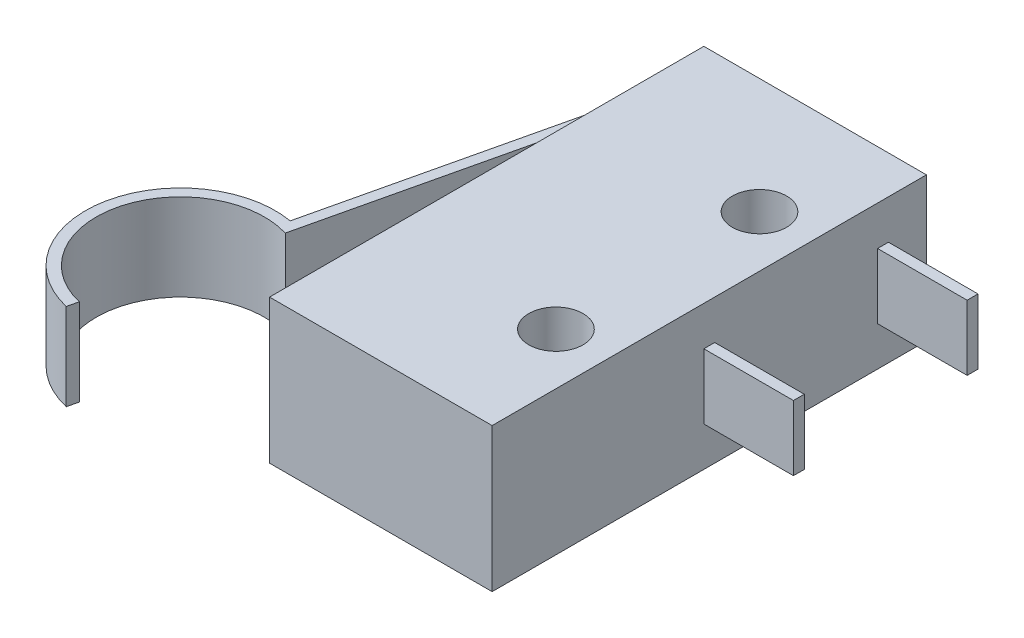
ISO-10303-21;
HEADER;
FILE_DESCRIPTION(('STEP AP214'),'2;1');
FILE_NAME('part.step','',(''),(''),'','','');
FILE_SCHEMA(('AUTOMOTIVE_DESIGN { 1 0 10303 214 1 1 1 1 }'));
ENDSEC;
DATA;
#1=APPLICATION_CONTEXT('core data for automotive mechanical design processes');
#2=APPLICATION_PROTOCOL_DEFINITION('international standard','automotive_design',2000,#1);
#3=PRODUCT_CONTEXT('',#1,'mechanical');
#4=PRODUCT('Part','Part','',(#3));
#5=PRODUCT_RELATED_PRODUCT_CATEGORY('part','',(#4));
#6=PRODUCT_DEFINITION_FORMATION('','',#4);
#7=PRODUCT_DEFINITION_CONTEXT('part definition',#1,'design');
#8=PRODUCT_DEFINITION('design','',#6,#7);
#9=PRODUCT_DEFINITION_SHAPE('','',#8);
#10=(LENGTH_UNIT() NAMED_UNIT(*) SI_UNIT(.MILLI.,.METRE.));
#11=(NAMED_UNIT(*) PLANE_ANGLE_UNIT() SI_UNIT($,.RADIAN.));
#12=(NAMED_UNIT(*) SI_UNIT($,.STERADIAN.) SOLID_ANGLE_UNIT());
#13=UNCERTAINTY_MEASURE_WITH_UNIT(LENGTH_MEASURE(1.E-05),#10,'distance_accuracy_value','');
#14=(GEOMETRIC_REPRESENTATION_CONTEXT(3) GLOBAL_UNCERTAINTY_ASSIGNED_CONTEXT((#13)) GLOBAL_UNIT_ASSIGNED_CONTEXT((#10,
#11,#12)) REPRESENTATION_CONTEXT('',''));
#15=CARTESIAN_POINT('',(0.,0.,0.));
#16=DIRECTION('',(0.,0.,1.));
#17=DIRECTION('',(1.,0.,0.));
#18=AXIS2_PLACEMENT_3D('',#15,#16,#17);
#19=CARTESIAN_POINT('',(0.,3.3655,-10.16));
#20=DIRECTION('',(0.,0.,1.));
#21=DIRECTION('',(1.,0.,0.));
#22=AXIS2_PLACEMENT_3D('',#19,#20,#21);
#23=PLANE('',#22);
#24=DIRECTION('',(-1.,0.,0.));
#25=VECTOR('',#24,1.);
#26=CARTESIAN_POINT('',(0.,-3.3655,-10.16));
#27=LINE('',#26,#25);
#28=CARTESIAN_POINT('',(5.207,-3.3655,-10.16));
#29=VERTEX_POINT('',#28);
#30=CARTESIAN_POINT('',(-5.207,-3.3655,-10.16));
#31=VERTEX_POINT('',#30);
#32=EDGE_CURVE('E397',#29,#31,#27,.T.);
#33=ORIENTED_EDGE('',*,*,#32,.T.);
#34=DIRECTION('',(0.,-1.,0.));
#35=VECTOR('',#34,1.);
#36=CARTESIAN_POINT('',(-5.207,3.3655,-10.16));
#37=LINE('',#36,#35);
#38=CARTESIAN_POINT('',(-5.207,3.3655,-10.16));
#39=VERTEX_POINT('',#38);
#40=EDGE_CURVE('E11',#39,#31,#37,.T.);
#41=ORIENTED_EDGE('',*,*,#40,.F.);
#42=DIRECTION('',(-1.,0.,0.));
#43=VECTOR('',#42,1.);
#44=CARTESIAN_POINT('',(0.,3.3655,-10.16));
#45=LINE('',#44,#43);
#46=CARTESIAN_POINT('',(5.207,3.3655,-10.16));
#47=VERTEX_POINT('',#46);
#48=EDGE_CURVE('E374',#47,#39,#45,.T.);
#49=ORIENTED_EDGE('',*,*,#48,.F.);
#50=DIRECTION('',(0.,-1.,0.));
#51=VECTOR('',#50,1.);
#52=CARTESIAN_POINT('',(5.207,3.3655,-10.16));
#53=LINE('',#52,#51);
#54=EDGE_CURVE('E389',#47,#29,#53,.T.);
#55=ORIENTED_EDGE('',*,*,#54,.T.);
#56=EDGE_LOOP('',(#33,#41,#49,#55));
#57=FACE_BOUND('',#56,.T.);
#58=ADVANCED_FACE('F45',(#57),#23,.F.);
#59=CARTESIAN_POINT('',(-5.207,3.3655,0.));
#60=DIRECTION('',(1.,0.,0.));
#61=DIRECTION('',(0.,0.,-1.));
#62=AXIS2_PLACEMENT_3D('',#59,#60,#61);
#63=PLANE('',#62);
#64=DIRECTION('',(0.,-1.,0.));
#65=VECTOR('',#64,1.);
#66=CARTESIAN_POINT('',(-5.207,2.032,-7.493));
#67=LINE('',#66,#65);
#68=CARTESIAN_POINT('',(-5.207,2.032,-7.493));
#69=VERTEX_POINT('',#68);
#70=CARTESIAN_POINT('',(-5.207,-2.032,-7.493));
#71=VERTEX_POINT('',#70);
#72=EDGE_CURVE('E66',#69,#71,#67,.T.);
#73=ORIENTED_EDGE('',*,*,#72,.F.);
#74=DIRECTION('',(0.,0.,1.));
#75=VECTOR('',#74,1.);
#76=CARTESIAN_POINT('',(-5.207,2.032,0.));
#77=LINE('',#76,#75);
#78=CARTESIAN_POINT('',(-5.207,2.032,-6.985));
#79=VERTEX_POINT('',#78);
#80=EDGE_CURVE('E61',#69,#79,#77,.T.);
#81=ORIENTED_EDGE('',*,*,#80,.T.);
#82=DIRECTION('',(0.,-1.,0.));
#83=VECTOR('',#82,1.);
#84=CARTESIAN_POINT('',(-5.207,2.032,-6.985));
#85=LINE('',#84,#83);
#86=CARTESIAN_POINT('',(-5.207,-2.032,-6.985));
#87=VERTEX_POINT('',#86);
#88=EDGE_CURVE('E270',#79,#87,#85,.T.);
#89=ORIENTED_EDGE('',*,*,#88,.T.);
#90=DIRECTION('',(0.,0.,1.));
#91=VECTOR('',#90,1.);
#92=CARTESIAN_POINT('',(-5.207,-2.032,0.));
#93=LINE('',#92,#91);
#94=EDGE_CURVE('E238',#71,#87,#93,.T.);
#95=ORIENTED_EDGE('',*,*,#94,.F.);
#96=EDGE_LOOP('',(#73,#81,#89,#95));
#97=FACE_BOUND('',#96,.T.);
#98=DIRECTION('',(0.,0.,1.));
#99=VECTOR('',#98,1.);
#100=CARTESIAN_POINT('',(-5.207,-3.3655,0.));
#101=LINE('',#100,#99);
#102=CARTESIAN_POINT('',(-5.207,-3.3655,10.16));
#103=VERTEX_POINT('',#102);
#104=EDGE_CURVE('E401',#31,#103,#101,.T.);
#105=ORIENTED_EDGE('',*,*,#104,.T.);
#106=DIRECTION('',(0.,-1.,0.));
#107=VECTOR('',#106,1.);
#108=CARTESIAN_POINT('',(-5.207,3.3655,10.16));
#109=LINE('',#108,#107);
#110=CARTESIAN_POINT('',(-5.207,3.3655,10.16));
#111=VERTEX_POINT('',#110);
#112=EDGE_CURVE('E54',#111,#103,#109,.T.);
#113=ORIENTED_EDGE('',*,*,#112,.F.);
#114=DIRECTION('',(0.,0.,1.));
#115=VECTOR('',#114,1.);
#116=CARTESIAN_POINT('',(-5.207,3.3655,0.));
#117=LINE('',#116,#115);
#118=EDGE_CURVE('E378',#39,#111,#117,.T.);
#119=ORIENTED_EDGE('',*,*,#118,.F.);
#120=ORIENTED_EDGE('',*,*,#40,.T.);
#121=EDGE_LOOP('',(#105,#113,#119,#120));
#122=FACE_BOUND('',#121,.T.);
#123=ADVANCED_FACE('F423',(#97,#122),#63,.F.);
#124=CARTESIAN_POINT('',(0.,3.3655,10.16));
#125=DIRECTION('',(0.,0.,1.));
#126=DIRECTION('',(1.,0.,0.));
#127=AXIS2_PLACEMENT_3D('',#124,#125,#126);
#128=PLANE('',#127);
#129=DIRECTION('',(-1.,0.,0.));
#130=VECTOR('',#129,1.);
#131=CARTESIAN_POINT('',(0.,-3.3655,10.16));
#132=LINE('',#131,#130);
#133=CARTESIAN_POINT('',(5.207,-3.3655,10.16));
#134=VERTEX_POINT('',#133);
#135=EDGE_CURVE('E405',#134,#103,#132,.T.);
#136=ORIENTED_EDGE('',*,*,#135,.F.);
#137=DIRECTION('',(0.,-1.,0.));
#138=VECTOR('',#137,1.);
#139=CARTESIAN_POINT('',(5.207,3.3655,10.16));
#140=LINE('',#139,#138);
#141=CARTESIAN_POINT('',(5.207,3.3655,10.16));
#142=VERTEX_POINT('',#141);
#143=EDGE_CURVE('E414',#142,#134,#140,.T.);
#144=ORIENTED_EDGE('',*,*,#143,.F.);
#145=DIRECTION('',(-1.,0.,0.));
#146=VECTOR('',#145,1.);
#147=CARTESIAN_POINT('',(0.,3.3655,10.16));
#148=LINE('',#147,#146);
#149=EDGE_CURVE('E381',#142,#111,#148,.T.);
#150=ORIENTED_EDGE('',*,*,#149,.T.);
#151=ORIENTED_EDGE('',*,*,#112,.T.);
#152=EDGE_LOOP('',(#136,#144,#150,#151));
#153=FACE_BOUND('',#152,.T.);
#154=ADVANCED_FACE('F420',(#153),#128,.T.);
#155=CARTESIAN_POINT('',(2.794,3.3655,-4.7625));
#156=DIRECTION('',(0.,-1.,0.));
#157=DIRECTION('',(0.,0.,-1.));
#158=AXIS2_PLACEMENT_3D('',#155,#156,#157);
#159=CYLINDRICAL_SURFACE('',#158,1.27);
#160=CARTESIAN_POINT('',(2.794,3.3655,-4.7625));
#161=DIRECTION('',(0.,1.,0.));
#162=DIRECTION('',(0.,0.,1.));
#163=AXIS2_PLACEMENT_3D('',#160,#161,#162);
#164=CIRCLE('',#163,1.27);
#165=CARTESIAN_POINT('',(2.794,3.3655,-3.4925));
#166=VERTEX_POINT('',#165);
#167=EDGE_CURVE('E369',#166,#166,#164,.T.);
#168=ORIENTED_EDGE('',*,*,#167,.T.);
#169=EDGE_LOOP('',(#168));
#170=FACE_BOUND('',#169,.T.);
#171=CARTESIAN_POINT('',(2.794,-3.3655,-4.7625));
#172=DIRECTION('',(0.,1.,0.));
#173=DIRECTION('',(0.,0.,1.));
#174=AXIS2_PLACEMENT_3D('',#171,#172,#173);
#175=CIRCLE('',#174,1.27);
#176=CARTESIAN_POINT('',(2.794,-3.3655,-3.4925));
#177=VERTEX_POINT('',#176);
#178=EDGE_CURVE('E393',#177,#177,#175,.T.);
#179=ORIENTED_EDGE('',*,*,#178,.F.);
#180=EDGE_LOOP('',(#179));
#181=FACE_BOUND('',#180,.T.);
#182=ADVANCED_FACE('F443',(#170,#181),#159,.F.);
#183=CARTESIAN_POINT('',(2.794,3.3655,4.7625));
#184=DIRECTION('',(0.,-1.,0.));
#185=DIRECTION('',(0.,0.,-1.));
#186=AXIS2_PLACEMENT_3D('',#183,#184,#185);
#187=CYLINDRICAL_SURFACE('',#186,1.27);
#188=CARTESIAN_POINT('',(2.794,3.3655,4.7625));
#189=DIRECTION('',(0.,1.,0.));
#190=DIRECTION('',(0.,0.,1.));
#191=AXIS2_PLACEMENT_3D('',#188,#189,#190);
#192=CIRCLE('',#191,1.27);
#193=CARTESIAN_POINT('',(2.794,3.3655,6.0325));
#194=VERTEX_POINT('',#193);
#195=EDGE_CURVE('E365',#194,#194,#192,.T.);
#196=ORIENTED_EDGE('',*,*,#195,.T.);
#197=EDGE_LOOP('',(#196));
#198=FACE_BOUND('',#197,.T.);
#199=CARTESIAN_POINT('',(2.794,-3.3655,4.7625));
#200=DIRECTION('',(0.,1.,0.));
#201=DIRECTION('',(0.,0.,1.));
#202=AXIS2_PLACEMENT_3D('',#199,#200,#201);
#203=CIRCLE('',#202,1.27);
#204=CARTESIAN_POINT('',(2.794,-3.3655,6.0325));
#205=VERTEX_POINT('',#204);
#206=EDGE_CURVE('E364',#205,#205,#203,.T.);
#207=ORIENTED_EDGE('',*,*,#206,.F.);
#208=EDGE_LOOP('',(#207));
#209=FACE_BOUND('',#208,.T.);
#210=ADVANCED_FACE('F47',(#198,#209),#187,.F.);
#211=CARTESIAN_POINT('',(5.207,3.3655,0.));
#212=DIRECTION('',(1.,0.,0.));
#213=DIRECTION('',(0.,0.,-1.));
#214=AXIS2_PLACEMENT_3D('',#211,#212,#213);
#215=PLANE('',#214);
#216=DIRECTION('',(0.,0.,1.));
#217=VECTOR('',#216,1.);
#218=CARTESIAN_POINT('',(5.207,1.524,0.));
#219=LINE('',#218,#217);
#220=CARTESIAN_POINT('',(5.207,1.524,-8.382));
#221=VERTEX_POINT('',#220);
#222=CARTESIAN_POINT('',(5.207,1.524,-7.874));
#223=VERTEX_POINT('',#222);
#224=EDGE_CURVE('E287',#221,#223,#219,.T.);
#225=ORIENTED_EDGE('',*,*,#224,.F.);
#226=DIRECTION('',(0.,-1.,0.));
#227=VECTOR('',#226,1.);
#228=CARTESIAN_POINT('',(5.207,1.524,-8.382));
#229=LINE('',#228,#227);
#230=CARTESIAN_POINT('',(5.207,-1.524,-8.382));
#231=VERTEX_POINT('',#230);
#232=EDGE_CURVE('E308',#221,#231,#229,.T.);
#233=ORIENTED_EDGE('',*,*,#232,.T.);
#234=DIRECTION('',(0.,0.,1.));
#235=VECTOR('',#234,1.);
#236=CARTESIAN_POINT('',(5.207,-1.524,0.));
#237=LINE('',#236,#235);
#238=CARTESIAN_POINT('',(5.207,-1.524,-7.874));
#239=VERTEX_POINT('',#238);
#240=EDGE_CURVE('E280',#231,#239,#237,.T.);
#241=ORIENTED_EDGE('',*,*,#240,.T.);
#242=DIRECTION('',(0.,-1.,0.));
#243=VECTOR('',#242,1.);
#244=CARTESIAN_POINT('',(5.207,1.524,-7.874));
#245=LINE('',#244,#243);
#246=EDGE_CURVE('E290',#223,#239,#245,.T.);
#247=ORIENTED_EDGE('',*,*,#246,.F.);
#248=EDGE_LOOP('',(#225,#233,#241,#247));
#249=FACE_BOUND('',#248,.T.);
#250=DIRECTION('',(0.,0.,1.));
#251=VECTOR('',#250,1.);
#252=CARTESIAN_POINT('',(5.207,1.524,0.));
#253=LINE('',#252,#251);
#254=CARTESIAN_POINT('',(5.207,1.524,-0.253999999999999));
#255=VERTEX_POINT('',#254);
#256=CARTESIAN_POINT('',(5.207,1.524,0.254));
#257=VERTEX_POINT('',#256);
#258=EDGE_CURVE('E332',#255,#257,#253,.T.);
#259=ORIENTED_EDGE('',*,*,#258,.F.);
#260=DIRECTION('',(0.,-1.,0.));
#261=VECTOR('',#260,1.);
#262=CARTESIAN_POINT('',(5.207,1.524,-0.253999999999999));
#263=LINE('',#262,#261);
#264=CARTESIAN_POINT('',(5.207,-1.524,-0.253999999999999));
#265=VERTEX_POINT('',#264);
#266=EDGE_CURVE('E353',#255,#265,#263,.T.);
#267=ORIENTED_EDGE('',*,*,#266,.T.);
#268=DIRECTION('',(0.,0.,1.));
#269=VECTOR('',#268,1.);
#270=CARTESIAN_POINT('',(5.207,-1.524,0.));
#271=LINE('',#270,#269);
#272=CARTESIAN_POINT('',(5.207,-1.524,0.254));
#273=VERTEX_POINT('',#272);
#274=EDGE_CURVE('E325',#265,#273,#271,.T.);
#275=ORIENTED_EDGE('',*,*,#274,.T.);
#276=DIRECTION('',(0.,-1.,0.));
#277=VECTOR('',#276,1.);
#278=CARTESIAN_POINT('',(5.207,1.524,0.254));
#279=LINE('',#278,#277);
#280=EDGE_CURVE('E335',#257,#273,#279,.T.);
#281=ORIENTED_EDGE('',*,*,#280,.F.);
#282=EDGE_LOOP('',(#259,#267,#275,#281));
#283=FACE_BOUND('',#282,.T.);
#284=DIRECTION('',(0.,0.,1.));
#285=VECTOR('',#284,1.);
#286=CARTESIAN_POINT('',(5.207,-3.3655,0.));
#287=LINE('',#286,#285);
#288=EDGE_CURVE('E370',#29,#134,#287,.T.);
#289=ORIENTED_EDGE('',*,*,#288,.F.);
#290=ORIENTED_EDGE('',*,*,#54,.F.);
#291=DIRECTION('',(0.,0.,1.));
#292=VECTOR('',#291,1.);
#293=CARTESIAN_POINT('',(5.207,3.3655,0.));
#294=LINE('',#293,#292);
#295=EDGE_CURVE('E385',#47,#142,#294,.T.);
#296=ORIENTED_EDGE('',*,*,#295,.T.);
#297=ORIENTED_EDGE('',*,*,#143,.T.);
#298=EDGE_LOOP('',(#289,#290,#296,#297));
#299=FACE_BOUND('',#298,.T.);
#300=ADVANCED_FACE('F430',(#249,#283,#299),#215,.T.);
#301=CARTESIAN_POINT('',(0.,3.3655,0.));
#302=DIRECTION('',(0.,1.,0.));
#303=DIRECTION('',(0.,0.,1.));
#304=AXIS2_PLACEMENT_3D('',#301,#302,#303);
#305=PLANE('',#304);
#306=ORIENTED_EDGE('',*,*,#195,.F.);
#307=EDGE_LOOP('',(#306));
#308=FACE_BOUND('',#307,.T.);
#309=ORIENTED_EDGE('',*,*,#167,.F.);
#310=EDGE_LOOP('',(#309));
#311=FACE_BOUND('',#310,.T.);
#312=ORIENTED_EDGE('',*,*,#48,.T.);
#313=ORIENTED_EDGE('',*,*,#118,.T.);
#314=ORIENTED_EDGE('',*,*,#149,.F.);
#315=ORIENTED_EDGE('',*,*,#295,.F.);
#316=EDGE_LOOP('',(#312,#313,#314,#315));
#317=FACE_BOUND('',#316,.T.);
#318=ADVANCED_FACE('F434',(#308,#311,#317),#305,.T.);
#319=CARTESIAN_POINT('',(0.,-3.3655,0.));
#320=DIRECTION('',(0.,1.,0.));
#321=DIRECTION('',(0.,0.,1.));
#322=AXIS2_PLACEMENT_3D('',#319,#320,#321);
#323=PLANE('',#322);
#324=ORIENTED_EDGE('',*,*,#206,.T.);
#325=EDGE_LOOP('',(#324));
#326=FACE_BOUND('',#325,.T.);
#327=ORIENTED_EDGE('',*,*,#178,.T.);
#328=EDGE_LOOP('',(#327));
#329=FACE_BOUND('',#328,.T.);
#330=ORIENTED_EDGE('',*,*,#32,.F.);
#331=ORIENTED_EDGE('',*,*,#288,.T.);
#332=ORIENTED_EDGE('',*,*,#135,.T.);
#333=ORIENTED_EDGE('',*,*,#104,.F.);
#334=EDGE_LOOP('',(#330,#331,#332,#333));
#335=FACE_BOUND('',#334,.T.);
#336=ADVANCED_FACE('F427',(#326,#329,#335),#323,.F.);
#337=CARTESIAN_POINT('',(0.,1.524,0.254));
#338=DIRECTION('',(0.,0.,-1.));
#339=DIRECTION('',(-1.,0.,0.));
#340=AXIS2_PLACEMENT_3D('',#337,#338,#339);
#341=PLANE('',#340);
#342=DIRECTION('',(1.,0.,0.));
#343=VECTOR('',#342,1.);
#344=CARTESIAN_POINT('',(0.,-1.524,0.254));
#345=LINE('',#344,#343);
#346=CARTESIAN_POINT('',(9.398,-1.524,0.254));
#347=VERTEX_POINT('',#346);
#348=EDGE_CURVE('E319',#273,#347,#345,.T.);
#349=ORIENTED_EDGE('',*,*,#348,.T.);
#350=DIRECTION('',(0.,-1.,0.));
#351=VECTOR('',#350,1.);
#352=CARTESIAN_POINT('',(9.398,1.524,0.254));
#353=LINE('',#352,#351);
#354=CARTESIAN_POINT('',(9.398,1.524,0.254));
#355=VERTEX_POINT('',#354);
#356=EDGE_CURVE('E360',#355,#347,#353,.T.);
#357=ORIENTED_EDGE('',*,*,#356,.F.);
#358=DIRECTION('',(1.,0.,0.));
#359=VECTOR('',#358,1.);
#360=CARTESIAN_POINT('',(0.,1.524,0.254));
#361=LINE('',#360,#359);
#362=EDGE_CURVE('E320',#257,#355,#361,.T.);
#363=ORIENTED_EDGE('',*,*,#362,.F.);
#364=ORIENTED_EDGE('',*,*,#280,.T.);
#365=EDGE_LOOP('',(#349,#357,#363,#364));
#366=FACE_BOUND('',#365,.T.);
#367=ADVANCED_FACE('F456',(#366),#341,.F.);
#368=CARTESIAN_POINT('',(9.398,1.524,0.));
#369=DIRECTION('',(-1.,0.,0.));
#370=DIRECTION('',(0.,0.,1.));
#371=AXIS2_PLACEMENT_3D('',#368,#369,#370);
#372=PLANE('',#371);
#373=DIRECTION('',(0.,0.,-1.));
#374=VECTOR('',#373,1.);
#375=CARTESIAN_POINT('',(9.398,-1.524,0.));
#376=LINE('',#375,#374);
#377=CARTESIAN_POINT('',(9.398,-1.524,-0.254));
#378=VERTEX_POINT('',#377);
#379=EDGE_CURVE('E339',#347,#378,#376,.T.);
#380=ORIENTED_EDGE('',*,*,#379,.T.);
#381=DIRECTION('',(0.,-1.,0.));
#382=VECTOR('',#381,1.);
#383=CARTESIAN_POINT('',(9.398,1.524,-0.254));
#384=LINE('',#383,#382);
#385=CARTESIAN_POINT('',(9.398,1.524,-0.254));
#386=VERTEX_POINT('',#385);
#387=EDGE_CURVE('E357',#386,#378,#384,.T.);
#388=ORIENTED_EDGE('',*,*,#387,.F.);
#389=DIRECTION('',(0.,0.,-1.));
#390=VECTOR('',#389,1.);
#391=CARTESIAN_POINT('',(9.398,1.524,0.));
#392=LINE('',#391,#390);
#393=EDGE_CURVE('E324',#355,#386,#392,.T.);
#394=ORIENTED_EDGE('',*,*,#393,.F.);
#395=ORIENTED_EDGE('',*,*,#356,.T.);
#396=EDGE_LOOP('',(#380,#388,#394,#395));
#397=FACE_BOUND('',#396,.T.);
#398=ADVANCED_FACE('F463',(#397),#372,.F.);
#399=CARTESIAN_POINT('',(0.,1.524,-0.253999999999997));
#400=DIRECTION('',(0.,0.,-1.));
#401=DIRECTION('',(-1.,0.,0.));
#402=AXIS2_PLACEMENT_3D('',#399,#400,#401);
#403=PLANE('',#402);
#404=DIRECTION('',(1.,0.,0.));
#405=VECTOR('',#404,1.);
#406=CARTESIAN_POINT('',(0.,-1.524,-0.253999999999997));
#407=LINE('',#406,#405);
#408=EDGE_CURVE('E343',#265,#378,#407,.T.);
#409=ORIENTED_EDGE('',*,*,#408,.F.);
#410=ORIENTED_EDGE('',*,*,#266,.F.);
#411=DIRECTION('',(1.,0.,0.));
#412=VECTOR('',#411,1.);
#413=CARTESIAN_POINT('',(0.,1.524,-0.253999999999997));
#414=LINE('',#413,#412);
#415=EDGE_CURVE('E328',#255,#386,#414,.T.);
#416=ORIENTED_EDGE('',*,*,#415,.T.);
#417=ORIENTED_EDGE('',*,*,#387,.T.);
#418=EDGE_LOOP('',(#409,#410,#416,#417));
#419=FACE_BOUND('',#418,.T.);
#420=ADVANCED_FACE('F487',(#419),#403,.T.);
#421=CARTESIAN_POINT('',(0.,1.524,0.));
#422=DIRECTION('',(0.,1.,0.));
#423=DIRECTION('',(0.,0.,1.));
#424=AXIS2_PLACEMENT_3D('',#421,#422,#423);
#425=PLANE('',#424);
#426=ORIENTED_EDGE('',*,*,#362,.T.);
#427=ORIENTED_EDGE('',*,*,#393,.T.);
#428=ORIENTED_EDGE('',*,*,#415,.F.);
#429=ORIENTED_EDGE('',*,*,#258,.T.);
#430=EDGE_LOOP('',(#426,#427,#428,#429));
#431=FACE_BOUND('',#430,.T.);
#432=ADVANCED_FACE('F481',(#431),#425,.T.);
#433=CARTESIAN_POINT('',(0.,-1.524,0.));
#434=DIRECTION('',(0.,1.,0.));
#435=DIRECTION('',(0.,0.,1.));
#436=AXIS2_PLACEMENT_3D('',#433,#434,#435);
#437=PLANE('',#436);
#438=ORIENTED_EDGE('',*,*,#348,.F.);
#439=ORIENTED_EDGE('',*,*,#274,.F.);
#440=ORIENTED_EDGE('',*,*,#408,.T.);
#441=ORIENTED_EDGE('',*,*,#379,.F.);
#442=EDGE_LOOP('',(#438,#439,#440,#441));
#443=FACE_BOUND('',#442,.T.);
#444=ADVANCED_FACE('F489',(#443),#437,.F.);
#445=CARTESIAN_POINT('',(0.,1.524,-7.874));
#446=DIRECTION('',(0.,0.,-1.));
#447=DIRECTION('',(-1.,0.,0.));
#448=AXIS2_PLACEMENT_3D('',#445,#446,#447);
#449=PLANE('',#448);
#450=DIRECTION('',(1.,0.,0.));
#451=VECTOR('',#450,1.);
#452=CARTESIAN_POINT('',(0.,-1.524,-7.874));
#453=LINE('',#452,#451);
#454=CARTESIAN_POINT('',(9.398,-1.524,-7.874));
#455=VERTEX_POINT('',#454);
#456=EDGE_CURVE('E194',#239,#455,#453,.T.);
#457=ORIENTED_EDGE('',*,*,#456,.T.);
#458=DIRECTION('',(0.,-1.,0.));
#459=VECTOR('',#458,1.);
#460=CARTESIAN_POINT('',(9.398,1.524,-7.874));
#461=LINE('',#460,#459);
#462=CARTESIAN_POINT('',(9.398,1.524,-7.874));
#463=VERTEX_POINT('',#462);
#464=EDGE_CURVE('E315',#463,#455,#461,.T.);
#465=ORIENTED_EDGE('',*,*,#464,.F.);
#466=DIRECTION('',(1.,0.,0.));
#467=VECTOR('',#466,1.);
#468=CARTESIAN_POINT('',(0.,1.524,-7.874));
#469=LINE('',#468,#467);
#470=EDGE_CURVE('E275',#223,#463,#469,.T.);
#471=ORIENTED_EDGE('',*,*,#470,.F.);
#472=ORIENTED_EDGE('',*,*,#246,.T.);
#473=EDGE_LOOP('',(#457,#465,#471,#472));
#474=FACE_BOUND('',#473,.T.);
#475=ADVANCED_FACE('F491',(#474),#449,.F.);
#476=CARTESIAN_POINT('',(9.398,1.524,0.));
#477=DIRECTION('',(-1.,0.,0.));
#478=DIRECTION('',(0.,0.,1.));
#479=AXIS2_PLACEMENT_3D('',#476,#477,#478);
#480=PLANE('',#479);
#481=DIRECTION('',(0.,0.,-1.));
#482=VECTOR('',#481,1.);
#483=CARTESIAN_POINT('',(9.398,-1.524,0.));
#484=LINE('',#483,#482);
#485=CARTESIAN_POINT('',(9.398,-1.524,-8.382));
#486=VERTEX_POINT('',#485);
#487=EDGE_CURVE('E294',#455,#486,#484,.T.);
#488=ORIENTED_EDGE('',*,*,#487,.T.);
#489=DIRECTION('',(0.,-1.,0.));
#490=VECTOR('',#489,1.);
#491=CARTESIAN_POINT('',(9.398,1.524,-8.382));
#492=LINE('',#491,#490);
#493=CARTESIAN_POINT('',(9.398,1.524,-8.382));
#494=VERTEX_POINT('',#493);
#495=EDGE_CURVE('E312',#494,#486,#492,.T.);
#496=ORIENTED_EDGE('',*,*,#495,.F.);
#497=DIRECTION('',(0.,0.,-1.));
#498=VECTOR('',#497,1.);
#499=CARTESIAN_POINT('',(9.398,1.524,0.));
#500=LINE('',#499,#498);
#501=EDGE_CURVE('E279',#463,#494,#500,.T.);
#502=ORIENTED_EDGE('',*,*,#501,.F.);
#503=ORIENTED_EDGE('',*,*,#464,.T.);
#504=EDGE_LOOP('',(#488,#496,#502,#503));
#505=FACE_BOUND('',#504,.T.);
#506=ADVANCED_FACE('F497',(#505),#480,.F.);
#507=CARTESIAN_POINT('',(0.,1.524,-8.382));
#508=DIRECTION('',(0.,0.,-1.));
#509=DIRECTION('',(-1.,0.,0.));
#510=AXIS2_PLACEMENT_3D('',#507,#508,#509);
#511=PLANE('',#510);
#512=DIRECTION('',(1.,0.,0.));
#513=VECTOR('',#512,1.);
#514=CARTESIAN_POINT('',(0.,-1.524,-8.382));
#515=LINE('',#514,#513);
#516=EDGE_CURVE('E298',#231,#486,#515,.T.);
#517=ORIENTED_EDGE('',*,*,#516,.F.);
#518=ORIENTED_EDGE('',*,*,#232,.F.);
#519=DIRECTION('',(1.,0.,0.));
#520=VECTOR('',#519,1.);
#521=CARTESIAN_POINT('',(0.,1.524,-8.382));
#522=LINE('',#521,#520);
#523=EDGE_CURVE('E283',#221,#494,#522,.T.);
#524=ORIENTED_EDGE('',*,*,#523,.T.);
#525=ORIENTED_EDGE('',*,*,#495,.T.);
#526=EDGE_LOOP('',(#517,#518,#524,#525));
#527=FACE_BOUND('',#526,.T.);
#528=ADVANCED_FACE('F539',(#527),#511,.T.);
#529=CARTESIAN_POINT('',(0.,1.524,0.));
#530=DIRECTION('',(0.,1.,0.));
#531=DIRECTION('',(0.,0.,1.));
#532=AXIS2_PLACEMENT_3D('',#529,#530,#531);
#533=PLANE('',#532);
#534=ORIENTED_EDGE('',*,*,#470,.T.);
#535=ORIENTED_EDGE('',*,*,#501,.T.);
#536=ORIENTED_EDGE('',*,*,#523,.F.);
#537=ORIENTED_EDGE('',*,*,#224,.T.);
#538=EDGE_LOOP('',(#534,#535,#536,#537));
#539=FACE_BOUND('',#538,.T.);
#540=ADVANCED_FACE('F550',(#539),#533,.T.);
#541=CARTESIAN_POINT('',(0.,-1.524,0.));
#542=DIRECTION('',(0.,1.,0.));
#543=DIRECTION('',(0.,0.,1.));
#544=AXIS2_PLACEMENT_3D('',#541,#542,#543);
#545=PLANE('',#544);
#546=ORIENTED_EDGE('',*,*,#456,.F.);
#547=ORIENTED_EDGE('',*,*,#240,.F.);
#548=ORIENTED_EDGE('',*,*,#516,.T.);
#549=ORIENTED_EDGE('',*,*,#487,.F.);
#550=EDGE_LOOP('',(#546,#547,#548,#549));
#551=FACE_BOUND('',#550,.T.);
#552=ADVANCED_FACE('F561',(#551),#545,.F.);
#553=CARTESIAN_POINT('',(-9.906,2.032,9.63462193862737));
#554=DIRECTION('',(0.,-1.,0.));
#555=DIRECTION('',(0.,0.,-1.));
#556=AXIS2_PLACEMENT_3D('',#553,#554,#555);
#557=CYLINDRICAL_SURFACE('',#556,3.937);
#558=CARTESIAN_POINT('',(-9.906,-2.032,9.63462193862737));
#559=DIRECTION('',(0.,1.,0.));
#560=DIRECTION('',(0.,0.,1.));
#561=AXIS2_PLACEMENT_3D('',#558,#559,#560);
#562=CIRCLE('',#561,3.937);
#563=CARTESIAN_POINT('',(-8.76594288970532,-2.032,5.86630151896205));
#564=VERTEX_POINT('',#563);
#565=CARTESIAN_POINT('',(-10.800564542305,-2.032,13.4686437538562));
#566=VERTEX_POINT('',#565);
#567=EDGE_CURVE('E188',#564,#566,#562,.T.);
#568=ORIENTED_EDGE('',*,*,#567,.F.);
#569=DIRECTION('',(0.,-1.,0.));
#570=VECTOR('',#569,1.);
#571=CARTESIAN_POINT('',(-8.76594288970532,2.032,5.86630151896205));
#572=LINE('',#571,#570);
#573=CARTESIAN_POINT('',(-8.76594288970532,2.032,5.86630151896205));
#574=VERTEX_POINT('',#573);
#575=EDGE_CURVE('E182',#574,#564,#572,.T.);
#576=ORIENTED_EDGE('',*,*,#575,.F.);
#577=CARTESIAN_POINT('',(-9.906,2.032,9.63462193862737));
#578=DIRECTION('',(0.,1.,0.));
#579=DIRECTION('',(0.,0.,1.));
#580=AXIS2_PLACEMENT_3D('',#577,#578,#579);
#581=CIRCLE('',#580,3.937);
#582=CARTESIAN_POINT('',(-10.800564542305,2.032,13.4686437538562));
#583=VERTEX_POINT('',#582);
#584=EDGE_CURVE('E185',#574,#583,#581,.T.);
#585=ORIENTED_EDGE('',*,*,#584,.T.);
#586=DIRECTION('',(0.,-1.,0.));
#587=VECTOR('',#586,1.);
#588=CARTESIAN_POINT('',(-10.800564542305,2.032,13.4686437538562));
#589=LINE('',#588,#587);
#590=EDGE_CURVE('E228',#583,#566,#589,.T.);
#591=ORIENTED_EDGE('',*,*,#590,.T.);
#592=EDGE_LOOP('',(#568,#576,#585,#591));
#593=FACE_BOUND('',#592,.T.);
#594=ADVANCED_FACE('F184',(#593),#557,.F.);
#595=CARTESIAN_POINT('',(-7.01529217989087,2.032,-1.63682731619131));
#596=DIRECTION('',(0.973843488755102,0.,0.227219848185168));
#597=DIRECTION('',(0.227219848185168,0.,-0.973843488755102));
#598=AXIS2_PLACEMENT_3D('',#595,#596,#597);
#599=PLANE('',#598);
#600=DIRECTION('',(-0.227219848185168,0.,0.973843488755102));
#601=VECTOR('',#600,1.);
#602=CARTESIAN_POINT('',(-7.01529217989087,-2.032,-1.63682731619131));
#603=LINE('',#602,#601);
#604=CARTESIAN_POINT('',(-5.76744178163384,-2.032,-6.985));
#605=VERTEX_POINT('',#604);
#606=EDGE_CURVE('E231',#605,#564,#603,.T.);
#607=ORIENTED_EDGE('',*,*,#606,.F.);
#608=DIRECTION('',(0.,-1.,0.));
#609=VECTOR('',#608,1.);
#610=CARTESIAN_POINT('',(-5.76744178163384,2.032,-6.985));
#611=LINE('',#610,#609);
#612=CARTESIAN_POINT('',(-5.76744178163384,2.032,-6.985));
#613=VERTEX_POINT('',#612);
#614=EDGE_CURVE('E195',#613,#605,#611,.T.);
#615=ORIENTED_EDGE('',*,*,#614,.F.);
#616=DIRECTION('',(-0.227219848185168,0.,0.973843488755102));
#617=VECTOR('',#616,1.);
#618=CARTESIAN_POINT('',(-7.01529217989087,2.032,-1.63682731619131));
#619=LINE('',#618,#617);
#620=EDGE_CURVE('E201',#613,#574,#619,.T.);
#621=ORIENTED_EDGE('',*,*,#620,.T.);
#622=ORIENTED_EDGE('',*,*,#575,.T.);
#623=EDGE_LOOP('',(#607,#615,#621,#622));
#624=FACE_BOUND('',#623,.T.);
#625=ADVANCED_FACE('F208',(#624),#599,.T.);
#626=CARTESIAN_POINT('',(0.,2.032,-6.985));
#627=DIRECTION('',(0.,0.,1.));
#628=DIRECTION('',(1.,0.,0.));
#629=AXIS2_PLACEMENT_3D('',#626,#627,#628);
#630=PLANE('',#629);
#631=DIRECTION('',(-1.,0.,0.));
#632=VECTOR('',#631,1.);
#633=CARTESIAN_POINT('',(0.,-2.032,-6.985));
#634=LINE('',#633,#632);
#635=EDGE_CURVE('E234',#87,#605,#634,.T.);
#636=ORIENTED_EDGE('',*,*,#635,.F.);
#637=ORIENTED_EDGE('',*,*,#88,.F.);
#638=DIRECTION('',(-1.,0.,0.));
#639=VECTOR('',#638,1.);
#640=CARTESIAN_POINT('',(0.,2.032,-6.985));
#641=LINE('',#640,#639);
#642=EDGE_CURVE('E210',#79,#613,#641,.T.);
#643=ORIENTED_EDGE('',*,*,#642,.T.);
#644=ORIENTED_EDGE('',*,*,#614,.T.);
#645=EDGE_LOOP('',(#636,#637,#643,#644));
#646=FACE_BOUND('',#645,.T.);
#647=ADVANCED_FACE('F600',(#646),#630,.T.);
#648=CARTESIAN_POINT('',(0.,2.032,-7.493));
#649=DIRECTION('',(0.,0.,1.));
#650=DIRECTION('',(1.,0.,0.));
#651=AXIS2_PLACEMENT_3D('',#648,#649,#650);
#652=PLANE('',#651);
#653=DIRECTION('',(-1.,0.,0.));
#654=VECTOR('',#653,1.);
#655=CARTESIAN_POINT('',(0.,-2.032,-7.493));
#656=LINE('',#655,#654);
#657=CARTESIAN_POINT('',(-6.17055821836616,-2.032,-7.493));
#658=VERTEX_POINT('',#657);
#659=EDGE_CURVE('E242',#71,#658,#656,.T.);
#660=ORIENTED_EDGE('',*,*,#659,.T.);
#661=DIRECTION('',(0.,-1.,0.));
#662=VECTOR('',#661,1.);
#663=CARTESIAN_POINT('',(-6.17055821836616,2.032,-7.493));
#664=LINE('',#663,#662);
#665=CARTESIAN_POINT('',(-6.17055821836616,2.032,-7.493));
#666=VERTEX_POINT('',#665);
#667=EDGE_CURVE('E264',#666,#658,#664,.T.);
#668=ORIENTED_EDGE('',*,*,#667,.F.);
#669=DIRECTION('',(-1.,0.,0.));
#670=VECTOR('',#669,1.);
#671=CARTESIAN_POINT('',(0.,2.032,-7.493));
#672=LINE('',#671,#670);
#673=EDGE_CURVE('E217',#69,#666,#672,.T.);
#674=ORIENTED_EDGE('',*,*,#673,.F.);
#675=ORIENTED_EDGE('',*,*,#72,.T.);
#676=EDGE_LOOP('',(#660,#668,#674,#675));
#677=FACE_BOUND('',#676,.T.);
#678=ADVANCED_FACE('F610',(#677),#652,.F.);
#679=CARTESIAN_POINT('',(-7.51000467217846,2.032,-1.75225499906938));
#680=DIRECTION('',(0.973843488755102,0.,0.227219848185168));
#681=DIRECTION('',(0.227219848185168,0.,-0.973843488755102));
#682=AXIS2_PLACEMENT_3D('',#679,#680,#681);
#683=PLANE('',#682);
#684=DIRECTION('',(-0.227219848185168,0.,0.973843488755102));
#685=VECTOR('',#684,1.);
#686=CARTESIAN_POINT('',(-7.51000467217846,-2.032,-1.75225499906938));
#687=LINE('',#686,#685);
#688=CARTESIAN_POINT('',(-9.1450143361566,-2.032,5.25524688967063));
#689=VERTEX_POINT('',#688);
#690=EDGE_CURVE('E245',#658,#689,#687,.T.);
#691=ORIENTED_EDGE('',*,*,#690,.T.);
#692=DIRECTION('',(0.,-1.,0.));
#693=VECTOR('',#692,1.);
#694=CARTESIAN_POINT('',(-9.1450143361566,2.032,5.25524688967063));
#695=LINE('',#694,#693);
#696=CARTESIAN_POINT('',(-9.1450143361566,2.032,5.25524688967063));
#697=VERTEX_POINT('',#696);
#698=EDGE_CURVE('E260',#697,#689,#695,.T.);
#699=ORIENTED_EDGE('',*,*,#698,.F.);
#700=DIRECTION('',(-0.227219848185168,0.,0.973843488755102));
#701=VECTOR('',#700,1.);
#702=CARTESIAN_POINT('',(-7.51000467217846,2.032,-1.75225499906938));
#703=LINE('',#702,#701);
#704=EDGE_CURVE('E220',#666,#697,#703,.T.);
#705=ORIENTED_EDGE('',*,*,#704,.F.);
#706=ORIENTED_EDGE('',*,*,#667,.T.);
#707=EDGE_LOOP('',(#691,#699,#705,#706));
#708=FACE_BOUND('',#707,.T.);
#709=ADVANCED_FACE('F621',(#708),#683,.F.);
#710=CARTESIAN_POINT('',(-9.906,2.032,9.63462193862737));
#711=DIRECTION('',(0.,-1.,0.));
#712=DIRECTION('',(0.,0.,-1.));
#713=AXIS2_PLACEMENT_3D('',#710,#711,#712);
#714=CYLINDRICAL_SURFACE('',#713,4.445);
#715=CARTESIAN_POINT('',(-9.906,-2.032,9.63462193862737));
#716=DIRECTION('',(0.,1.,0.));
#717=DIRECTION('',(0.,0.,1.));
#718=AXIS2_PLACEMENT_3D('',#715,#716,#717);
#719=CIRCLE('',#718,4.445);
#720=CARTESIAN_POINT('',(-10.9159922251831,-2.032,13.9633562461438));
#721=VERTEX_POINT('',#720);
#722=EDGE_CURVE('E248',#689,#721,#719,.T.);
#723=ORIENTED_EDGE('',*,*,#722,.T.);
#724=DIRECTION('',(0.,-1.,0.));
#725=VECTOR('',#724,1.);
#726=CARTESIAN_POINT('',(-10.9159922251831,2.032,13.9633562461438));
#727=LINE('',#726,#725);
#728=CARTESIAN_POINT('',(-10.9159922251831,2.032,13.9633562461438));
#729=VERTEX_POINT('',#728);
#730=EDGE_CURVE('E257',#729,#721,#727,.T.);
#731=ORIENTED_EDGE('',*,*,#730,.F.);
#732=CARTESIAN_POINT('',(-9.906,2.032,9.63462193862737));
#733=DIRECTION('',(0.,1.,0.));
#734=DIRECTION('',(0.,0.,1.));
#735=AXIS2_PLACEMENT_3D('',#732,#733,#734);
#736=CIRCLE('',#735,4.445);
#737=EDGE_CURVE('E223',#697,#729,#736,.T.);
#738=ORIENTED_EDGE('',*,*,#737,.F.);
#739=ORIENTED_EDGE('',*,*,#698,.T.);
#740=EDGE_LOOP('',(#723,#731,#738,#739));
#741=FACE_BOUND('',#740,.T.);
#742=ADVANCED_FACE('F632',(#741),#714,.T.);
#743=CARTESIAN_POINT('',(-7.26264842603465,2.032,-1.69454115763035));
#744=DIRECTION('',(0.973843488755102,0.,0.227219848185169));
#745=DIRECTION('',(0.227219848185169,0.,-0.973843488755102));
#746=AXIS2_PLACEMENT_3D('',#743,#744,#745);
#747=PLANE('',#746);
#748=DIRECTION('',(-0.227219848185169,0.,0.973843488755102));
#749=VECTOR('',#748,1.);
#750=CARTESIAN_POINT('',(-7.26264842603465,-2.032,-1.69454115763035));
#751=LINE('',#750,#749);
#752=EDGE_CURVE('E206',#566,#721,#751,.T.);
#753=ORIENTED_EDGE('',*,*,#752,.F.);
#754=ORIENTED_EDGE('',*,*,#590,.F.);
#755=DIRECTION('',(-0.227219848185169,0.,0.973843488755102));
#756=VECTOR('',#755,1.);
#757=CARTESIAN_POINT('',(-7.26264842603465,2.032,-1.69454115763035));
#758=LINE('',#757,#756);
#759=EDGE_CURVE('E204',#583,#729,#758,.T.);
#760=ORIENTED_EDGE('',*,*,#759,.T.);
#761=ORIENTED_EDGE('',*,*,#730,.T.);
#762=EDGE_LOOP('',(#753,#754,#760,#761));
#763=FACE_BOUND('',#762,.T.);
#764=ADVANCED_FACE('F643',(#763),#747,.T.);
#765=CARTESIAN_POINT('',(0.,2.032,0.));
#766=DIRECTION('',(0.,1.,0.));
#767=DIRECTION('',(0.,0.,1.));
#768=AXIS2_PLACEMENT_3D('',#765,#766,#767);
#769=PLANE('',#768);
#770=ORIENTED_EDGE('',*,*,#584,.F.);
#771=ORIENTED_EDGE('',*,*,#620,.F.);
#772=ORIENTED_EDGE('',*,*,#642,.F.);
#773=ORIENTED_EDGE('',*,*,#80,.F.);
#774=ORIENTED_EDGE('',*,*,#673,.T.);
#775=ORIENTED_EDGE('',*,*,#704,.T.);
#776=ORIENTED_EDGE('',*,*,#737,.T.);
#777=ORIENTED_EDGE('',*,*,#759,.F.);
#778=EDGE_LOOP('',(#770,#771,#772,#773,#774,#775,#776,#777));
#779=FACE_BOUND('',#778,.T.);
#780=ADVANCED_FACE('F199',(#779),#769,.T.);
#781=CARTESIAN_POINT('',(0.,-2.032,0.));
#782=DIRECTION('',(0.,1.,0.));
#783=DIRECTION('',(0.,0.,1.));
#784=AXIS2_PLACEMENT_3D('',#781,#782,#783);
#785=PLANE('',#784);
#786=ORIENTED_EDGE('',*,*,#567,.T.);
#787=ORIENTED_EDGE('',*,*,#752,.T.);
#788=ORIENTED_EDGE('',*,*,#722,.F.);
#789=ORIENTED_EDGE('',*,*,#690,.F.);
#790=ORIENTED_EDGE('',*,*,#659,.F.);
#791=ORIENTED_EDGE('',*,*,#94,.T.);
#792=ORIENTED_EDGE('',*,*,#635,.T.);
#793=ORIENTED_EDGE('',*,*,#606,.T.);
#794=EDGE_LOOP('',(#786,#787,#788,#789,#790,#791,#792,#793));
#795=FACE_BOUND('',#794,.T.);
#796=ADVANCED_FACE('F664',(#795),#785,.F.);
#797=CLOSED_SHELL('',(#58,#123,#154,#182,#210,#300,#318,#336,#367,#398,#420,#432,#444,#475,#506,
#528,#540,#552,#594,#625,#647,#678,#709,#742,#764,#780,#796));
#798=MANIFOLD_SOLID_BREP('B2',#797);
#799=ADVANCED_BREP_SHAPE_REPRESENTATION('',(#18,#798),#14);
#800=SHAPE_DEFINITION_REPRESENTATION(#9,#799);
ENDSEC;
END-ISO-10303-21;
